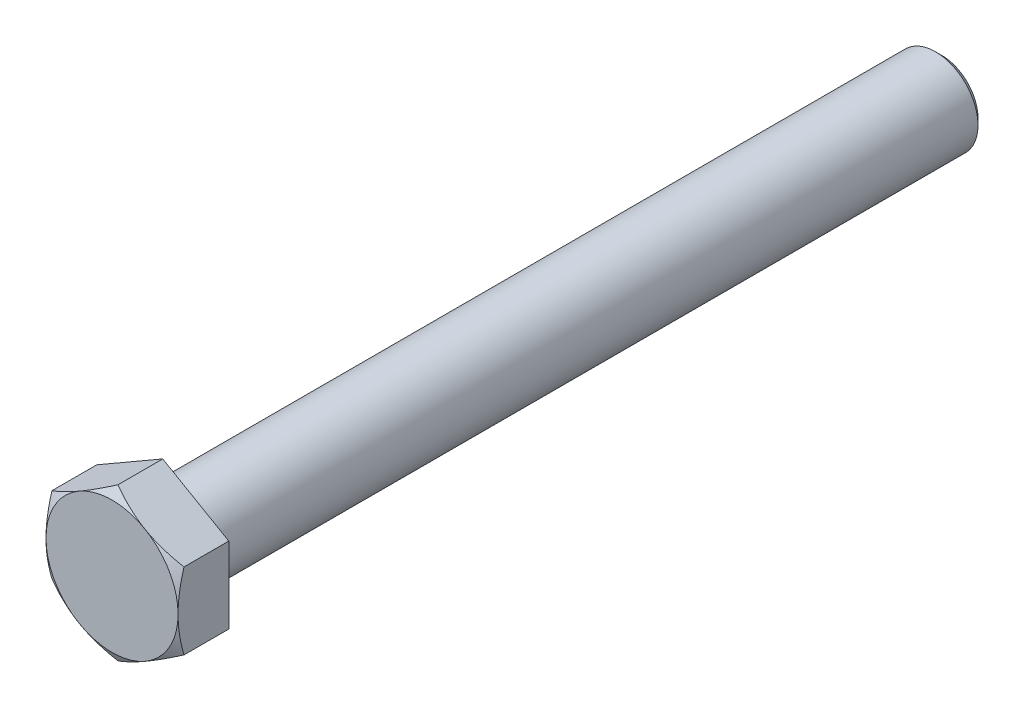
ISO-10303-21;
HEADER;
FILE_DESCRIPTION(('STEP AP214'),'2;1');
FILE_NAME('part.step','',(''),(''),'','','');
FILE_SCHEMA(('AUTOMOTIVE_DESIGN { 1 0 10303 214 1 1 1 1 }'));
ENDSEC;
DATA;
#1=APPLICATION_CONTEXT('core data for automotive mechanical design processes');
#2=APPLICATION_PROTOCOL_DEFINITION('international standard','automotive_design',2000,#1);
#3=PRODUCT_CONTEXT('',#1,'mechanical');
#4=PRODUCT('Part','Part','',(#3));
#5=PRODUCT_RELATED_PRODUCT_CATEGORY('part','',(#4));
#6=PRODUCT_DEFINITION_FORMATION('','',#4);
#7=PRODUCT_DEFINITION_CONTEXT('part definition',#1,'design');
#8=PRODUCT_DEFINITION('design','',#6,#7);
#9=PRODUCT_DEFINITION_SHAPE('','',#8);
#10=(LENGTH_UNIT() NAMED_UNIT(*) SI_UNIT(.MILLI.,.METRE.));
#11=(NAMED_UNIT(*) PLANE_ANGLE_UNIT() SI_UNIT($,.RADIAN.));
#12=(NAMED_UNIT(*) SI_UNIT($,.STERADIAN.) SOLID_ANGLE_UNIT());
#13=UNCERTAINTY_MEASURE_WITH_UNIT(LENGTH_MEASURE(1.E-05),#10,'distance_accuracy_value','');
#14=(GEOMETRIC_REPRESENTATION_CONTEXT(3) GLOBAL_UNCERTAINTY_ASSIGNED_CONTEXT((#13)) GLOBAL_UNIT_ASSIGNED_CONTEXT((#10,
#11,#12)) REPRESENTATION_CONTEXT('',''));
#15=CARTESIAN_POINT('',(0.,0.,0.));
#16=DIRECTION('',(0.,0.,1.));
#17=DIRECTION('',(1.,0.,0.));
#18=AXIS2_PLACEMENT_3D('',#15,#16,#17);
#19=CARTESIAN_POINT('',(0.,0.,0.));
#20=DIRECTION('',(0.,0.,1.));
#21=DIRECTION('',(1.,0.,0.));
#22=AXIS2_PLACEMENT_3D('',#19,#20,#21);
#23=PLANE('',#22);
#24=CARTESIAN_POINT('',(0.,0.,0.));
#25=DIRECTION('',(0.,0.,1.));
#26=DIRECTION('',(1.,0.,0.));
#27=AXIS2_PLACEMENT_3D('',#24,#25,#26);
#28=CIRCLE('',#27,6.6);
#29=CARTESIAN_POINT('',(6.6,0.,0.));
#30=VERTEX_POINT('',#29);
#31=EDGE_CURVE('E183',#30,#30,#28,.T.);
#32=ORIENTED_EDGE('',*,*,#31,.T.);
#33=EDGE_LOOP('',(#32));
#34=FACE_BOUND('',#33,.T.);
#35=CARTESIAN_POINT('',(0.,0.,0.));
#36=DIRECTION('',(0.,0.,1.));
#37=DIRECTION('',(1.,0.,0.));
#38=AXIS2_PLACEMENT_3D('',#35,#36,#37);
#39=CIRCLE('',#38,8.7);
#40=CARTESIAN_POINT('',(8.7,0.,0.));
#41=VERTEX_POINT('',#40);
#42=EDGE_CURVE('E367',#41,#41,#39,.T.);
#43=ORIENTED_EDGE('',*,*,#42,.F.);
#44=EDGE_LOOP('',(#43));
#45=FACE_BOUND('',#44,.T.);
#46=ADVANCED_FACE('F63',(#34,#45),#23,.F.);
#47=CARTESIAN_POINT('',(0.,0.,-0.599999999999934));
#48=DIRECTION('',(0.,0.,1.));
#49=DIRECTION('',(1.,0.,0.));
#50=AXIS2_PLACEMENT_3D('',#47,#48,#49);
#51=TOROIDAL_SURFACE('',#50,6.6,0.6);
#52=ORIENTED_EDGE('',*,*,#31,.F.);
#53=EDGE_LOOP('',(#52));
#54=FACE_BOUND('',#53,.T.);
#55=CARTESIAN_POINT('',(0.,0.,-0.599999999999934));
#56=DIRECTION('',(0.,0.,1.));
#57=DIRECTION('',(1.,0.,0.));
#58=AXIS2_PLACEMENT_3D('',#55,#56,#57);
#59=CIRCLE('',#58,6.00000000000001);
#60=CARTESIAN_POINT('',(6.00000000000001,0.,-0.599999999999902));
#61=VERTEX_POINT('',#60);
#62=EDGE_CURVE('E187',#61,#61,#59,.T.);
#63=ORIENTED_EDGE('',*,*,#62,.T.);
#64=EDGE_LOOP('',(#63));
#65=FACE_BOUND('',#64,.T.);
#66=ADVANCED_FACE('F279',(#54,#65),#51,.F.);
#67=CARTESIAN_POINT('',(0.,0.,0.));
#68=DIRECTION('',(0.,0.,1.));
#69=DIRECTION('',(1.,0.,0.));
#70=AXIS2_PLACEMENT_3D('',#67,#68,#69);
#71=CYLINDRICAL_SURFACE('',#70,6.00000000000001);
#72=ORIENTED_EDGE('',*,*,#62,.F.);
#73=EDGE_LOOP('',(#72));
#74=FACE_BOUND('',#73,.T.);
#75=CARTESIAN_POINT('',(-2.66453525910038E-12,1.55431223447522E-12,-109.1));
#76=DIRECTION('',(0.,0.,1.));
#77=DIRECTION('',(1.,0.,0.));
#78=AXIS2_PLACEMENT_3D('',#75,#76,#77);
#79=CIRCLE('',#78,6.00000000000002);
#80=CARTESIAN_POINT('',(5.99999999999735,1.55431223447285E-12,-109.1));
#81=VERTEX_POINT('',#80);
#82=EDGE_CURVE('E191',#81,#81,#79,.T.);
#83=ORIENTED_EDGE('',*,*,#82,.T.);
#84=EDGE_LOOP('',(#83));
#85=FACE_BOUND('',#84,.T.);
#86=ADVANCED_FACE('F285',(#74,#85),#71,.T.);
#87=CARTESIAN_POINT('',(-2.66453525910038E-12,0.,-110.));
#88=DIRECTION('',(0.,0.,1.));
#89=DIRECTION('',(1.,0.,0.));
#90=AXIS2_PLACEMENT_3D('',#87,#88,#89);
#91=CONICAL_SURFACE('',#90,5.1,0.78539816339745);
#92=ORIENTED_EDGE('',*,*,#82,.F.);
#93=EDGE_LOOP('',(#92));
#94=FACE_BOUND('',#93,.T.);
#95=CARTESIAN_POINT('',(-2.66453525910038E-12,0.,-110.));
#96=DIRECTION('',(0.,0.,1.));
#97=DIRECTION('',(1.,0.,0.));
#98=AXIS2_PLACEMENT_3D('',#95,#96,#97);
#99=CIRCLE('',#98,5.1);
#100=CARTESIAN_POINT('',(5.09999999999734,0.,-110.));
#101=VERTEX_POINT('',#100);
#102=EDGE_CURVE('E154',#101,#101,#99,.T.);
#103=ORIENTED_EDGE('',*,*,#102,.T.);
#104=EDGE_LOOP('',(#103));
#105=FACE_BOUND('',#104,.T.);
#106=ADVANCED_FACE('F382',(#94,#105),#91,.T.);
#107=CARTESIAN_POINT('',(-2.66453525910038E-12,5.1000000000001,-109.999999999989));
#108=DIRECTION('',(0.,0.,1.));
#109=DIRECTION('',(1.,0.,0.));
#110=AXIS2_PLACEMENT_3D('',#107,#108,#109);
#111=PLANE('',#110);
#112=ORIENTED_EDGE('',*,*,#102,.F.);
#113=EDGE_LOOP('',(#112));
#114=FACE_BOUND('',#113,.T.);
#115=ADVANCED_FACE('F378',(#114),#111,.F.);
#116=CARTESIAN_POINT('',(-2.66453525910038E-12,10.7791295257702,0.150000000010753));
#117=DIRECTION('',(0.,0.,-1.));
#118=DIRECTION('',(-1.,0.,0.));
#119=AXIS2_PLACEMENT_3D('',#116,#117,#118);
#120=PLANE('',#119);
#121=CARTESIAN_POINT('',(0.,0.,0.150000000000095));
#122=DIRECTION('',(0.,0.,1.));
#123=DIRECTION('',(1.,0.,0.));
#124=AXIS2_PLACEMENT_3D('',#121,#122,#123);
#125=CIRCLE('',#124,8.78660254037844);
#126=CARTESIAN_POINT('',(8.78660254037844,0.,0.150000000000141));
#127=VERTEX_POINT('',#126);
#128=EDGE_CURVE('E362',#127,#127,#125,.T.);
#129=ORIENTED_EDGE('',*,*,#128,.T.);
#130=EDGE_LOOP('',(#129));
#131=FACE_BOUND('',#130,.T.);
#132=DIRECTION('',(0.866025403784439,-0.5,0.));
#133=VECTOR('',#132,1.);
#134=CARTESIAN_POINT('',(9.33500000000032,5.38956476288466,0.150000000001205));
#135=LINE('',#134,#133);
#136=CARTESIAN_POINT('',(-2.66453525910038E-12,10.7791295257702,0.150000000010753));
#137=VERTEX_POINT('',#136);
#138=CARTESIAN_POINT('',(9.33500000000032,5.38956476288466,0.150000000001205));
#139=VERTEX_POINT('',#138);
#140=EDGE_CURVE('E87',#137,#139,#135,.T.);
#141=ORIENTED_EDGE('',*,*,#140,.T.);
#142=DIRECTION('',(0.,-1.,0.));
#143=VECTOR('',#142,1.);
#144=CARTESIAN_POINT('',(9.33499999999521,-5.38956476288555,0.150000000009198));
#145=LINE('',#144,#143);
#146=CARTESIAN_POINT('',(9.33499999999521,-5.38956476288577,0.150000000009198));
#147=VERTEX_POINT('',#146);
#148=EDGE_CURVE('E13',#139,#147,#145,.T.);
#149=ORIENTED_EDGE('',*,*,#148,.T.);
#150=DIRECTION('',(-0.866025403784439,-0.5,0.));
#151=VECTOR('',#150,1.);
#152=CARTESIAN_POINT('',(0.,-10.7791295257704,0.150000000000095));
#153=LINE('',#152,#151);
#154=CARTESIAN_POINT('',(0.,-10.7791295257704,0.150000000000095));
#155=VERTEX_POINT('',#154);
#156=EDGE_CURVE('E203',#147,#155,#153,.T.);
#157=ORIENTED_EDGE('',*,*,#156,.T.);
#158=DIRECTION('',(-0.866025403784439,0.5,0.));
#159=VECTOR('',#158,1.);
#160=CARTESIAN_POINT('',(-9.33499999999543,-5.38956476288577,0.150000000009198));
#161=LINE('',#160,#159);
#162=CARTESIAN_POINT('',(-9.33499999999543,-5.38956476288577,0.150000000009198));
#163=VERTEX_POINT('',#162);
#164=EDGE_CURVE('E200',#155,#163,#161,.T.);
#165=ORIENTED_EDGE('',*,*,#164,.T.);
#166=DIRECTION('',(0.,1.,0.));
#167=VECTOR('',#166,1.);
#168=CARTESIAN_POINT('',(-9.33500000000076,5.38956476288444,0.150000000001205));
#169=LINE('',#168,#167);
#170=CARTESIAN_POINT('',(-9.33500000000076,5.38956476288444,0.150000000001205));
#171=VERTEX_POINT('',#170);
#172=EDGE_CURVE('E138',#163,#171,#169,.T.);
#173=ORIENTED_EDGE('',*,*,#172,.T.);
#174=DIRECTION('',(0.866025403784439,0.499999999999999,0.));
#175=VECTOR('',#174,1.);
#176=CARTESIAN_POINT('',(-2.66453525910038E-12,10.7791295257702,0.150000000010753));
#177=LINE('',#176,#175);
#178=EDGE_CURVE('E135',#171,#137,#177,.T.);
#179=ORIENTED_EDGE('',*,*,#178,.T.);
#180=EDGE_LOOP('',(#141,#149,#157,#165,#173,#179));
#181=FACE_BOUND('',#180,.T.);
#182=ADVANCED_FACE('F136',(#131,#181),#120,.T.);
#183=CARTESIAN_POINT('',(0.,0.,0.150000000000095));
#184=DIRECTION('',(0.,0.,1.));
#185=DIRECTION('',(1.,0.,0.));
#186=AXIS2_PLACEMENT_3D('',#183,#184,#185);
#187=CONICAL_SURFACE('',#186,8.78660254037844,0.5235987755983);
#188=ORIENTED_EDGE('',*,*,#42,.T.);
#189=EDGE_LOOP('',(#188));
#190=FACE_BOUND('',#189,.T.);
#191=ORIENTED_EDGE('',*,*,#128,.F.);
#192=EDGE_LOOP('',(#191));
#193=FACE_BOUND('',#192,.T.);
#194=ADVANCED_FACE('F229',(#190,#193),#187,.T.);
#195=CARTESIAN_POINT('',(9.33499999999521,-5.38956476288632,7.32000000000954));
#196=DIRECTION('',(-1.,0.,0.));
#197=DIRECTION('',(0.,-1.,0.));
#198=AXIS2_PLACEMENT_3D('',#195,#196,#197);
#199=PLANE('',#198);
#200=CARTESIAN_POINT('',(9.3350000000052,-14.293920006569,2.85295320593915));
#201=CARTESIAN_POINT('',(9.33499999999891,-14.0889979748924,2.95200947811314));
#202=CARTESIAN_POINT('',(9.33499999999624,-13.8838282501428,3.0505530905864));
#203=CARTESIAN_POINT('',(9.33499999999423,-13.4729410981221,3.24649731903918));
#204=CARTESIAN_POINT('',(9.33499999999488,-13.2672236648771,3.34389792248868));
#205=CARTESIAN_POINT('',(9.33499999999593,-12.6491110540922,3.63423693700223));
#206=CARTESIAN_POINT('',(9.33499999999542,-12.2358221904249,3.82528025364381));
#207=CARTESIAN_POINT('',(9.33499999999504,-11.4040234451105,4.20217310927833));
#208=CARTESIAN_POINT('',(9.33499999999518,-10.9854972201138,4.38798667007247));
#209=CARTESIAN_POINT('',(9.33499999999527,-10.1450055951429,4.75163580728445));
#210=CARTESIAN_POINT('',(9.33499999999524,-9.72304037579501,4.92947179955779));
#211=CARTESIAN_POINT('',(9.33499999999521,-8.86976005800029,5.27715066645903));
#212=CARTESIAN_POINT('',(9.33499999999522,-8.43839377157641,5.44686860657921));
#213=CARTESIAN_POINT('',(9.33499999999522,-7.57057438679324,5.77301256488771));
#214=CARTESIAN_POINT('',(9.33499999999522,-7.13412072861586,5.9294371042547));
#215=CARTESIAN_POINT('',(9.33499999999521,-6.25632320665389,6.22479025997486));
#216=CARTESIAN_POINT('',(9.33499999999522,-5.81499199640561,6.36375607260732));
#217=CARTESIAN_POINT('',(9.33499999999521,-4.926071334869,6.61968098547653));
#218=CARTESIAN_POINT('',(9.33499999999521,-4.47848391093945,6.73664704501836));
#219=CARTESIAN_POINT('',(9.33499999999521,-3.57667031207917,6.94288552890779));
#220=CARTESIAN_POINT('',(9.33499999999521,-3.12244240314022,7.03215057946999));
#221=CARTESIAN_POINT('',(9.33499999999521,-2.43710350689389,7.1408028211713));
#222=CARTESIAN_POINT('',(9.3349999999952,-2.20796291906161,7.17281503726789));
#223=CARTESIAN_POINT('',(9.33499999999521,-1.74860743174466,7.22779448911046));
#224=CARTESIAN_POINT('',(9.33499999999523,-1.51839264090194,7.25076262031284));
#225=CARTESIAN_POINT('',(9.33499999999519,-1.05866032543573,7.28703579917145));
#226=CARTESIAN_POINT('',(9.33499999999513,-0.829147554397095,7.30040085150142));
#227=CARTESIAN_POINT('',(9.33499999999528,-0.36976199715621,7.31739721140636));
#228=CARTESIAN_POINT('',(9.33499999999548,-0.139889215668003,7.32102864538625));
#229=CARTESIAN_POINT('',(9.33499999999493,0.319737952099457,7.31847123986833));
#230=CARTESIAN_POINT('',(9.33499999999417,0.549492353500248,7.31228515640284));
#231=CARTESIAN_POINT('',(9.33499999999624,1.00854016574407,7.29024654738927));
#232=CARTESIAN_POINT('',(9.33499999999909,1.23783355299208,7.2743935391115));
#233=CARTESIAN_POINT('',(9.33500000000045,1.79357012506222,7.2245863545867));
#234=CARTESIAN_POINT('',(9.33499999999661,2.11958632864142,7.18578870330947));
#235=CARTESIAN_POINT('',(9.3349999999938,2.76912050377091,7.09080439036909));
#236=CARTESIAN_POINT('',(9.33499999999483,3.09263776869831,7.03461298239965));
#237=CARTESIAN_POINT('',(9.33499999999558,3.73690716837019,6.90683408562929));
#238=CARTESIAN_POINT('',(9.3349999999953,4.05765638834971,6.83523203973706));
#239=CARTESIAN_POINT('',(9.33499999999511,4.69585477456245,6.67881653034498));
#240=CARTESIAN_POINT('',(9.33499999999519,5.01330424867442,6.59400431142417));
#241=CARTESIAN_POINT('',(9.33499999999523,5.652721853529,6.41098051072758));
#242=CARTESIAN_POINT('',(9.33499999999518,5.97461000804994,6.31249144069609));
#243=CARTESIAN_POINT('',(9.33499999999523,6.6149839511621,6.10578201115883));
#244=CARTESIAN_POINT('',(9.33499999999534,6.93347191931008,5.99756836371344));
#245=CARTESIAN_POINT('',(9.33499999999508,7.56576751363311,5.77364503844998));
#246=CARTESIAN_POINT('',(9.33499999999472,7.87959139359839,5.65798098174576));
#247=CARTESIAN_POINT('',(9.3349999999957,8.50480431543438,5.41986404687469));
#248=CARTESIAN_POINT('',(9.33499999999704,8.81619231437381,5.29740842489781));
#249=CARTESIAN_POINT('',(9.33500000000032,9.12644907509852,5.17222885598723));
#250=B_SPLINE_CURVE_WITH_KNOTS('',3,(#200,#201,#202,#203,#204,#205,#206,#207,#208,#209,#210,
#211,#212,#213,#214,#215,#216,#217,#218,#219,#220,#221,#222,#223,#224,#225,#226,#227,#228,#229,
#230,#231,#232,#233,#234,#235,#236,#237,#238,#239,#240,#241,#242,#243,#244,#245,#246,#247,#248,
#249),.UNSPECIFIED.,.F.,.F.,(4,2,2,2,2,2,2,2,2,2,2,2,2,2,2,2,2,2,2,2,2,2,2,2,4),(0.,
0.682821242993022,1.36564996430018,2.73152951663887,4.10522544602778,5.47884968384844,
6.86933776425463,8.25998032725456,9.64760794835491,11.0347958724484,12.4223527386713,
13.1163000222216,13.8101785806449,14.4996828280969,15.1891781213088,15.8784798895048,
16.5678160816453,17.5522174713355,18.5368877158509,19.5224922074135,20.5080038976525,
21.5176726092943,22.5266497067146,23.5299476031846,24.5336538298063),.UNSPECIFIED.);
#251=CARTESIAN_POINT('',(9.33499999999521,-5.38956476288788,6.48623142956128));
#252=VERTEX_POINT('',#251);
#253=CARTESIAN_POINT('',(9.33499999999965,-1.11022302462516E-12,7.32000000000421));
#254=VERTEX_POINT('',#253);
#255=EDGE_CURVE('E354',#252,#254,#250,.T.);
#256=ORIENTED_EDGE('',*,*,#255,.F.);
#257=DIRECTION('',(0.,0.,-1.));
#258=VECTOR('',#257,1.);
#259=CARTESIAN_POINT('',(9.33499999999521,-5.38956476288632,7.32000000000954));
#260=LINE('',#259,#258);
#261=EDGE_CURVE('E177',#252,#147,#260,.T.);
#262=ORIENTED_EDGE('',*,*,#261,.T.);
#263=ORIENTED_EDGE('',*,*,#148,.F.);
#264=DIRECTION('',(0.,0.,-1.));
#265=VECTOR('',#264,1.);
#266=CARTESIAN_POINT('',(9.33500000000032,5.38956476288388,7.3200000000011));
#267=LINE('',#266,#265);
#268=CARTESIAN_POINT('',(9.33499999999943,5.38956476288255,6.48623142955329));
#269=VERTEX_POINT('',#268);
#270=EDGE_CURVE('E152',#269,#139,#267,.T.);
#271=ORIENTED_EDGE('',*,*,#270,.F.);
#272=EDGE_CURVE('E234',#254,#269,#250,.T.);
#273=ORIENTED_EDGE('',*,*,#272,.F.);
#274=EDGE_LOOP('',(#256,#262,#263,#271,#273));
#275=FACE_BOUND('',#274,.T.);
#276=ADVANCED_FACE('F290',(#275),#199,.F.);
#277=CARTESIAN_POINT('',(0.,-10.7791295257755,7.31999999999999));
#278=DIRECTION('',(-0.499999999999999,0.866025403784439,0.));
#279=DIRECTION('',(-0.866025403784439,-0.5,0.));
#280=AXIS2_PLACEMENT_3D('',#277,#278,#279);
#281=PLANE('',#280);
#282=CARTESIAN_POINT('',(-0.000199999999894729,-10.7792449958242,6.48616476181374));
#283=CARTESIAN_POINT('',(0.205003739618677,-10.6607705615199,6.55455498933212));
#284=CARTESIAN_POINT('',(0.410972586004931,-10.5418543926155,6.61984121047945));
#285=CARTESIAN_POINT('',(0.824561997186706,-10.3030684347368,6.74334436956653));
#286=CARTESIAN_POINT('',(1.03218308144301,-10.1831983458516,6.80155898243248));
#287=CARTESIAN_POINT('',(1.65839174727736,-9.82165660406272,6.96446882046476));
#288=CARTESIAN_POINT('',(2.0794513746149,-9.57855771487475,7.05713121773747));
#289=CARTESIAN_POINT('',(2.70954783258533,-9.21477135525029,7.16578659054639));
#290=CARTESIAN_POINT('',(2.91670220163508,-9.09517072451565,7.19673843665258));
#291=CARTESIAN_POINT('',(3.33197005561744,-8.85541571723294,7.24864273857737));
#292=CARTESIAN_POINT('',(3.54008355893221,-8.73526133007191,7.26959500193874));
#293=CARTESIAN_POINT('',(3.95665771618454,-8.49475212824553,7.30096329051052));
#294=CARTESIAN_POINT('',(4.16511766131825,-8.37439772280828,7.31139183643182));
#295=CARTESIAN_POINT('',(4.58223010787757,-8.13357773950232,7.32149109381549));
#296=CARTESIAN_POINT('',(4.79088260315483,-8.01311216518336,7.32116213764982));
#297=CARTESIAN_POINT('',(5.18096381451784,-7.78789867279763,7.31049475071877));
#298=CARTESIAN_POINT('',(5.36242006195994,-7.68313485949393,7.30145760929093));
#299=CARTESIAN_POINT('',(5.72490816972366,-7.47385225290089,7.27542267819828));
#300=CARTESIAN_POINT('',(5.90593999911398,-7.36933347746973,7.25842432540492));
#301=CARTESIAN_POINT('',(6.44833403144247,-7.05618213689675,7.1958893355017));
#302=CARTESIAN_POINT('',(6.80873615765812,-6.84810387231012,7.13882055798183));
#303=CARTESIAN_POINT('',(7.53336341948346,-6.42974012763387,6.9961480122022));
#304=CARTESIAN_POINT('',(7.89749607658087,-6.21950804003821,6.909939472466));
#305=CARTESIAN_POINT('',(8.62033129112425,-5.80217893434057,6.71428185816434));
#306=CARTESIAN_POINT('',(8.9790431047511,-5.59507657218008,6.60487873715515));
#307=CARTESIAN_POINT('',(9.33519999999488,-5.38944929283414,6.48616476182329));
#308=B_SPLINE_CURVE_WITH_KNOTS('',3,(#282,#283,#284,#285,#286,#287,#288,#289,#290,#291,#292,
#293,#294,#295,#296,#297,#298,#299,#300,#301,#302,#303,#304,#305,#306,#307),.UNSPECIFIED.,.F.,
.F.,(4,2,2,2,2,2,2,2,2,2,2,2,4),(0.,0.739804294915854,1.47985117544356,2.96309532775769,
3.68651340422434,4.40994540341464,5.13251567287136,5.85506361726955,6.48407412042993,
7.1131291227587,8.37213305715012,9.65905881820603,10.9434583334545),.UNSPECIFIED.);
#309=CARTESIAN_POINT('',(0.,-10.7791295257702,6.48623142955174));
#310=VERTEX_POINT('',#309);
#311=CARTESIAN_POINT('',(4.66750000000005,-8.08434714433037,7.31999999999888));
#312=VERTEX_POINT('',#311);
#313=EDGE_CURVE('E304',#310,#312,#308,.T.);
#314=ORIENTED_EDGE('',*,*,#313,.F.);
#315=DIRECTION('',(0.,0.,-1.));
#316=VECTOR('',#315,1.);
#317=CARTESIAN_POINT('',(0.,-10.7791295257755,7.31999999999999));
#318=LINE('',#317,#316);
#319=EDGE_CURVE('E173',#310,#155,#318,.T.);
#320=ORIENTED_EDGE('',*,*,#319,.T.);
#321=ORIENTED_EDGE('',*,*,#156,.F.);
#322=ORIENTED_EDGE('',*,*,#261,.F.);
#323=EDGE_CURVE('E244',#312,#252,#308,.T.);
#324=ORIENTED_EDGE('',*,*,#323,.F.);
#325=EDGE_LOOP('',(#314,#320,#321,#322,#324));
#326=FACE_BOUND('',#325,.T.);
#327=ADVANCED_FACE('F293',(#326),#281,.F.);
#328=CARTESIAN_POINT('',(-9.33499999999543,-5.38956476288766,7.32000000000954));
#329=DIRECTION('',(0.5,0.866025403784439,0.));
#330=DIRECTION('',(-0.866025403784439,0.5,0.));
#331=AXIS2_PLACEMENT_3D('',#328,#329,#330);
#332=PLANE('',#331);
#333=CARTESIAN_POINT('',(-9.3351999999951,-5.38944929283236,6.48616476182329));
#334=CARTESIAN_POINT('',(-9.12999626037727,-5.50792372714048,6.55455498933569));
#335=CARTESIAN_POINT('',(-8.92402741399148,-5.62683989604643,6.61984121048043));
#336=CARTESIAN_POINT('',(-8.51043800281035,-5.86562585392616,6.74334436956546));
#337=CARTESIAN_POINT('',(-8.30281691855423,-5.98549594281076,6.80155898243195));
#338=CARTESIAN_POINT('',(-7.6766082527203,-6.3470376845987,6.96446882046505));
#339=CARTESIAN_POINT('',(-7.2555486253831,-6.59013657378684,7.0571312177372));
#340=CARTESIAN_POINT('',(-6.6254521674132,-6.95392293341116,7.16578659054583));
#341=CARTESIAN_POINT('',(-6.41829779836366,-7.07352356414568,7.19673843665201));
#342=CARTESIAN_POINT('',(-6.00302994438167,-7.31327857142809,7.24864273857693));
#343=CARTESIAN_POINT('',(-5.79491644106702,-7.43343295858895,7.26959500193843));
#344=CARTESIAN_POINT('',(-5.37834228381522,-7.6739421604153,7.30096329050985));
#345=CARTESIAN_POINT('',(-5.16988233868191,-7.79429656585271,7.31139183643067));
#346=CARTESIAN_POINT('',(-4.75276989212259,-8.03511654915761,7.32149109381583));
#347=CARTESIAN_POINT('',(-4.54411739684494,-8.15558212347535,7.32116213765213));
#348=CARTESIAN_POINT('',(-4.15403618548212,-8.38079561586119,7.3104947507209));
#349=CARTESIAN_POINT('',(-3.97257993804043,-8.48555942916592,7.3014576092914));
#350=CARTESIAN_POINT('',(-3.61009183027676,-8.69484203575992,7.27542267819754));
#351=CARTESIAN_POINT('',(-3.42906000088607,-8.79936081119098,7.25842432540462));
#352=CARTESIAN_POINT('',(-2.88666596855663,-9.11251215176396,7.19588933550203));
#353=CARTESIAN_POINT('',(-2.52626384234063,-9.32059041635094,7.13882055798164));
#354=CARTESIAN_POINT('',(-1.80163658051436,-9.73895416102818,6.99614801220201));
#355=CARTESIAN_POINT('',(-1.43750392341638,-9.94918624862451,6.90993947246635));
#356=CARTESIAN_POINT('',(-0.714668708871814,-10.3665153543217,6.71428185816288));
#357=CARTESIAN_POINT('',(-0.355956895244346,-10.5736177164811,6.60487873715135));
#358=CARTESIAN_POINT('',(0.000200000000116773,-10.7792449958242,6.48616476181374));
#359=B_SPLINE_CURVE_WITH_KNOTS('',3,(#333,#334,#335,#336,#337,#338,#339,#340,#341,#342,#343,
#344,#345,#346,#347,#348,#349,#350,#351,#352,#353,#354,#355,#356,#357,#358),.UNSPECIFIED.,.F.,
.F.,(4,2,2,2,2,2,2,2,2,2,2,2,4),(0.,0.739804294914861,1.47985117544177,2.96309532775486,
3.68651340422079,4.40994540341047,5.13251567286642,5.85506361726374,6.48407412042478,
7.11312912275432,8.37213305714737,9.65905881820528,10.9434583334556),.UNSPECIFIED.);
#360=CARTESIAN_POINT('',(-9.33499999999543,-5.38956476288632,6.48623142956128));
#361=VERTEX_POINT('',#360);
#362=CARTESIAN_POINT('',(-4.66750000000005,-8.08434714433037,7.32000000000421));
#363=VERTEX_POINT('',#362);
#364=EDGE_CURVE('E266',#361,#363,#359,.T.);
#365=ORIENTED_EDGE('',*,*,#364,.F.);
#366=DIRECTION('',(0.,0.,-1.));
#367=VECTOR('',#366,1.);
#368=CARTESIAN_POINT('',(-9.33499999999543,-5.38956476288766,7.32000000000954));
#369=LINE('',#368,#367);
#370=EDGE_CURVE('E167',#361,#163,#369,.T.);
#371=ORIENTED_EDGE('',*,*,#370,.T.);
#372=ORIENTED_EDGE('',*,*,#164,.F.);
#373=ORIENTED_EDGE('',*,*,#319,.F.);
#374=EDGE_CURVE('E252',#363,#310,#359,.T.);
#375=ORIENTED_EDGE('',*,*,#374,.F.);
#376=EDGE_LOOP('',(#365,#371,#372,#373,#375));
#377=FACE_BOUND('',#376,.T.);
#378=ADVANCED_FACE('F270',(#377),#332,.F.);
#379=CARTESIAN_POINT('',(-9.33499999999543,5.38956476288255,7.3200000000011));
#380=DIRECTION('',(1.,0.,0.));
#381=DIRECTION('',(0.,0.,-1.));
#382=AXIS2_PLACEMENT_3D('',#379,#380,#381);
#383=PLANE('',#382);
#384=CARTESIAN_POINT('',(-9.33500000000476,-14.293920006569,2.85295320593382));
#385=CARTESIAN_POINT('',(-9.33499999999885,-14.0889979748929,2.95200947810881));
#386=CARTESIAN_POINT('',(-9.33499999999635,-13.8838282501436,3.05055309058247));
#387=CARTESIAN_POINT('',(-9.33499999999446,-13.472941098123,3.24649731903549));
#388=CARTESIAN_POINT('',(-9.33499999999508,-13.267223664878,3.34389792248485));
#389=CARTESIAN_POINT('',(-9.33499999999607,-12.649111054093,3.63423693699811));
#390=CARTESIAN_POINT('',(-9.33499999999559,-12.2358221904258,3.8252802536397));
#391=CARTESIAN_POINT('',(-9.33499999999524,-11.4040234451112,4.20217310927423));
#392=CARTESIAN_POINT('',(-9.33499999999537,-10.9854972201142,4.38798667006837));
#393=CARTESIAN_POINT('',(-9.33499999999547,-10.1450055951428,4.75163580728036));
#394=CARTESIAN_POINT('',(-9.33499999999543,-9.72304037579469,4.92947179955372));
#395=CARTESIAN_POINT('',(-9.33499999999541,-8.86976005799949,5.2771506664549));
#396=CARTESIAN_POINT('',(-9.33499999999542,-8.43839377157536,5.44686860657498));
#397=CARTESIAN_POINT('',(-9.33499999999543,-7.57057438679167,5.77301256488362));
#398=CARTESIAN_POINT('',(-9.33499999999542,-7.13412072861404,5.92943710425084));
#399=CARTESIAN_POINT('',(-9.33499999999542,-6.25632320665144,6.22479025997018));
#400=CARTESIAN_POINT('',(-9.33499999999542,-5.81499199640278,6.3637560726016));
#401=CARTESIAN_POINT('',(-9.33499999999543,-4.92607133486661,6.61968098547307));
#402=CARTESIAN_POINT('',(-9.33499999999543,-4.47848391093788,6.73664704501819));
#403=CARTESIAN_POINT('',(-9.33499999999543,-3.57667031207779,6.94288552890703));
#404=CARTESIAN_POINT('',(-9.33499999999543,-3.12244240313822,7.03215057946536));
#405=CARTESIAN_POINT('',(-9.33499999999543,-2.43710350689178,7.1408028211652));
#406=CARTESIAN_POINT('',(-9.33499999999543,-2.20796291905955,7.17281503726203));
#407=CARTESIAN_POINT('',(-9.33499999999543,-1.74860743174266,7.22779448910471));
#408=CARTESIAN_POINT('',(-9.33499999999542,-1.51839264089995,7.25076262030698));
#409=CARTESIAN_POINT('',(-9.33499999999544,-1.05866032543381,7.28703579916537));
#410=CARTESIAN_POINT('',(-9.33499999999545,-0.82914755439524,7.30040085149525));
#411=CARTESIAN_POINT('',(-9.33499999999541,-0.369761997154412,7.31739721140032));
#412=CARTESIAN_POINT('',(-9.33499999999535,-0.139889215666196,7.32102864538045));
#413=CARTESIAN_POINT('',(-9.33499999999551,0.319737952101088,7.31847123986175));
#414=CARTESIAN_POINT('',(-9.33499999999574,0.549492353501694,7.31228515639527));
#415=CARTESIAN_POINT('',(-9.33499999999512,1.00854016574544,7.29024654738439));
#416=CARTESIAN_POINT('',(-9.33499999999427,1.23783355299356,7.27439353911029));
#417=CARTESIAN_POINT('',(-9.33499999999386,1.79357012506335,7.22458635458734));
#418=CARTESIAN_POINT('',(-9.33499999999501,2.11958632864182,7.18578870330523));
#419=CARTESIAN_POINT('',(-9.33499999999585,2.76912050377068,7.09080439036136));
#420=CARTESIAN_POINT('',(-9.33499999999554,3.09263776869818,7.03461298239331));
#421=CARTESIAN_POINT('',(-9.33499999999531,3.73690716837026,6.90683408562404));
#422=CARTESIAN_POINT('',(-9.33499999999539,4.05765638834987,6.8352320397315));
#423=CARTESIAN_POINT('',(-9.33499999999546,4.69585477456273,6.67881653033926));
#424=CARTESIAN_POINT('',(-9.33499999999544,5.01330424867474,6.59400431141861));
#425=CARTESIAN_POINT('',(-9.33499999999541,5.65272185352959,6.41098051072218));
#426=CARTESIAN_POINT('',(-9.33499999999539,5.97461000805076,6.31249144069068));
#427=CARTESIAN_POINT('',(-9.33499999999546,6.61498395116329,6.10578201115338));
#428=CARTESIAN_POINT('',(-9.33499999999553,6.93347191931139,5.99756836370796));
#429=CARTESIAN_POINT('',(-9.33499999999532,7.56576751363454,5.77364503844478));
#430=CARTESIAN_POINT('',(-9.33499999999504,7.87959139359981,5.65798098174089));
#431=CARTESIAN_POINT('',(-9.33499999999581,8.50480431543548,5.41986404686938));
#432=CARTESIAN_POINT('',(-9.33499999999686,8.81619231437459,5.29740842489175));
#433=CARTESIAN_POINT('',(-9.33499999999943,9.12644907509852,5.17222885597923));
#434=B_SPLINE_CURVE_WITH_KNOTS('',3,(#384,#385,#386,#387,#388,#389,#390,#391,#392,#393,#394,
#395,#396,#397,#398,#399,#400,#401,#402,#403,#404,#405,#406,#407,#408,#409,#410,#411,#412,#413,
#414,#415,#416,#417,#418,#419,#420,#421,#422,#423,#424,#425,#426,#427,#428,#429,#430,#431,#432,
#433),.UNSPECIFIED.,.F.,.F.,(4,2,2,2,2,2,2,2,2,2,2,2,2,2,2,2,2,2,2,2,2,2,2,2,4),(0.,
0.682821242992933,1.3656499643,2.7315295166386,4.10522544602822,5.47884968384949,
6.86933776425634,8.25998032725713,9.64760794835781,11.0347958724513,12.4223527386736,
13.1163000222239,13.8101785806472,14.499682828099,15.1891781213108,15.8784798895065,
16.5678160816465,17.552217471336,18.5368877158512,19.5224922074142,20.5080038976532,
21.5176726092957,22.5266497067164,23.529947603186,24.5336538298076),.UNSPECIFIED.);
#435=CARTESIAN_POINT('',(-9.33499999999943,5.3895647628841,6.48623142955329));
#436=VERTEX_POINT('',#435);
#437=CARTESIAN_POINT('',(-9.33499999999143,-2.66453525910038E-12,7.31999999999577));
#438=VERTEX_POINT('',#437);
#439=EDGE_CURVE('E265',#436,#438,#434,.F.);
#440=ORIENTED_EDGE('',*,*,#439,.F.);
#441=DIRECTION('',(0.,0.,-1.));
#442=VECTOR('',#441,1.);
#443=CARTESIAN_POINT('',(-9.33499999999543,5.38956476288255,7.3200000000011));
#444=LINE('',#443,#442);
#445=EDGE_CURVE('E161',#436,#171,#444,.T.);
#446=ORIENTED_EDGE('',*,*,#445,.T.);
#447=ORIENTED_EDGE('',*,*,#172,.F.);
#448=ORIENTED_EDGE('',*,*,#370,.F.);
#449=EDGE_CURVE('E258',#438,#361,#434,.F.);
#450=ORIENTED_EDGE('',*,*,#449,.F.);
#451=EDGE_LOOP('',(#440,#446,#447,#448,#450));
#452=FACE_BOUND('',#451,.T.);
#453=ADVANCED_FACE('F267',(#452),#383,.F.);
#454=CARTESIAN_POINT('',(2.66453525910038E-12,10.7791295257651,7.32000000001065));
#455=DIRECTION('',(0.499999999999999,-0.866025403784439,0.));
#456=DIRECTION('',(0.866025403784439,0.499999999999999,0.));
#457=AXIS2_PLACEMENT_3D('',#454,#455,#456);
#458=PLANE('',#457);
#459=CARTESIAN_POINT('',(0.000199999999894729,10.7792449958242,6.48616476182484));
#460=CARTESIAN_POINT('',(-0.205003739616705,10.6607705615135,6.55455498933595));
#461=CARTESIAN_POINT('',(-0.410972586001901,10.5418543926065,6.61984121048008));
#462=CARTESIAN_POINT('',(-0.824561997182476,10.303068434726,6.74334436956454));
#463=CARTESIAN_POINT('',(-1.03218308143863,10.1831983458417,6.80155898243106));
#464=CARTESIAN_POINT('',(-1.65839174727263,9.82165660405433,6.96446882046414));
#465=CARTESIAN_POINT('',(-2.07945137460973,9.57855771486603,7.05713121773606));
#466=CARTESIAN_POINT('',(-2.70954783257947,9.21477135524157,7.16578659054439));
#467=CARTESIAN_POINT('',(-2.91670220162895,9.09517072450704,7.19673843665048));
#468=CARTESIAN_POINT('',(-3.33197005561103,8.85541571722484,7.24864273857536));
#469=CARTESIAN_POINT('',(-3.5400835589258,8.73526133006423,7.26959500193691));
#470=CARTESIAN_POINT('',(-3.95665771617714,8.49475212823723,7.30096329050787));
#471=CARTESIAN_POINT('',(-4.16511766130986,8.37439772279894,7.31139183642819));
#472=CARTESIAN_POINT('',(-4.58223010787051,8.13357773949664,7.32149109381442));
#473=CARTESIAN_POINT('',(-4.79088260315008,8.01311216518238,7.3211621376523));
#474=CARTESIAN_POINT('',(-5.18096381451263,7.78789867279604,7.31049475072074));
#475=CARTESIAN_POINT('',(-5.36242006195264,7.6831348594882,7.30145760928975));
#476=CARTESIAN_POINT('',(-5.72490816971525,7.47385225289174,7.27542267819468));
#477=CARTESIAN_POINT('',(-5.90593999910654,7.36933347746133,7.25842432540204));
#478=CARTESIAN_POINT('',(-6.44833403143724,7.05618213688926,7.19588933549986));
#479=CARTESIAN_POINT('',(-6.80873615765334,6.84810387230157,7.13882055797915));
#480=CARTESIAN_POINT('',(-7.53336341947987,6.42974012762328,6.99614801219868));
#481=CARTESIAN_POINT('',(-7.89749607657802,6.21950804002664,6.90993947246249));
#482=CARTESIAN_POINT('',(-8.620331291124,5.80217893432997,6.71428185815983));
#483=CARTESIAN_POINT('',(-8.9790431047527,5.59507657217142,6.60487873714964));
#484=CARTESIAN_POINT('',(-9.33519999999954,5.38944929283014,6.48616476181529));
#485=B_SPLINE_CURVE_WITH_KNOTS('',3,(#459,#460,#461,#462,#463,#464,#465,#466,#467,#468,#469,
#470,#471,#472,#473,#474,#475,#476,#477,#478,#479,#480,#481,#482,#483,#484),.UNSPECIFIED.,.F.,
.F.,(4,2,2,2,2,2,2,2,2,2,2,2,4),(0.,0.73980429491443,1.47985117544098,2.96309532775387,
3.68651340421968,4.4099454034093,5.13251567286506,5.85506361726208,6.4840741204236,
7.11312912275371,8.37213305714806,9.6590588182073,10.9434583334584),.UNSPECIFIED.);
#486=CARTESIAN_POINT('',(0.,10.7791295257704,6.48623142956239));
#487=VERTEX_POINT('',#486);
#488=CARTESIAN_POINT('',(-4.66749999999472,8.08434714432504,7.32000000000421));
#489=VERTEX_POINT('',#488);
#490=EDGE_CURVE('E159',#487,#489,#485,.T.);
#491=ORIENTED_EDGE('',*,*,#490,.F.);
#492=DIRECTION('',(0.,0.,-1.));
#493=VECTOR('',#492,1.);
#494=CARTESIAN_POINT('',(2.66453525910038E-12,10.7791295257651,7.32000000001065));
#495=LINE('',#494,#493);
#496=EDGE_CURVE('E150',#487,#137,#495,.T.);
#497=ORIENTED_EDGE('',*,*,#496,.T.);
#498=ORIENTED_EDGE('',*,*,#178,.F.);
#499=ORIENTED_EDGE('',*,*,#445,.F.);
#500=EDGE_CURVE('E215',#489,#436,#485,.T.);
#501=ORIENTED_EDGE('',*,*,#500,.F.);
#502=EDGE_LOOP('',(#491,#497,#498,#499,#501));
#503=FACE_BOUND('',#502,.T.);
#504=ADVANCED_FACE('F157',(#503),#458,.F.);
#505=CARTESIAN_POINT('',(9.33500000000032,5.38956476288388,7.3200000000011));
#506=DIRECTION('',(-0.5,-0.866025403784439,0.));
#507=DIRECTION('',(0.866025403784439,-0.5,0.));
#508=AXIS2_PLACEMENT_3D('',#505,#506,#507);
#509=PLANE('',#508);
#510=CARTESIAN_POINT('',(9.33519999999954,5.38944929282859,6.48616476181529));
#511=CARTESIAN_POINT('',(9.12999626038297,5.50792372713614,6.55455498933284));
#512=CARTESIAN_POINT('',(8.92402741399769,5.62683989604186,6.61984121047972));
#513=CARTESIAN_POINT('',(8.51043800281692,5.86562585392144,6.74334436956626));
#514=CARTESIAN_POINT('',(8.30281691856065,5.98549594280611,6.80155898243212));
#515=CARTESIAN_POINT('',(7.6766082527265,6.34703768459415,6.9644688204641));
#516=CARTESIAN_POINT('',(7.2555486253894,6.59013657378223,7.05713121773652));
#517=CARTESIAN_POINT('',(6.6254521674195,6.95392293340658,7.16578659054501));
#518=CARTESIAN_POINT('',(6.41829779836991,7.07352356414114,7.19673843665107));
#519=CARTESIAN_POINT('',(6.00302994438777,7.31327857142359,7.24864273857576));
#520=CARTESIAN_POINT('',(5.79491644107306,7.43343295858442,7.26959500193716));
#521=CARTESIAN_POINT('',(5.37834228382125,7.67394216041095,7.30096329050841));
#522=CARTESIAN_POINT('',(5.169882338688,7.79429656584855,7.31139183642917));
#523=CARTESIAN_POINT('',(4.75276989212833,8.03511654915304,7.32149109381398));
#524=CARTESIAN_POINT('',(4.54411739685028,8.15558212347017,7.32116213765));
#525=CARTESIAN_POINT('',(4.15403618548733,8.3807956158562,7.3104947507186));
#526=CARTESIAN_POINT('',(3.97257993804581,8.48555942916159,7.30145760928916));
#527=CARTESIAN_POINT('',(3.6100918302821,8.69484203575616,7.27542267819519));
#528=CARTESIAN_POINT('',(3.42906000089119,8.79936081118716,7.25842432540209));
#529=CARTESIAN_POINT('',(2.88666596856117,9.1125121517602,7.19588933549921));
#530=CARTESIAN_POINT('',(2.52626384234486,9.32059041634751,7.13882055797893));
#531=CARTESIAN_POINT('',(1.8016365805183,9.73895416102499,6.99614801219808));
#532=CARTESIAN_POINT('',(1.43750392342033,9.94918624862121,6.90993947246107));
#533=CARTESIAN_POINT('',(0.714668708874845,10.3665153543191,6.71428185816018));
#534=CARTESIAN_POINT('',(0.355956895246439,10.5736177164792,6.60487873715257));
#535=CARTESIAN_POINT('',(-0.000200000000116773,10.7792449958242,6.48616476182484));
#536=B_SPLINE_CURVE_WITH_KNOTS('',3,(#510,#511,#512,#513,#514,#515,#516,#517,#518,#519,#520,
#521,#522,#523,#524,#525,#526,#527,#528,#529,#530,#531,#532,#533,#534,#535),.UNSPECIFIED.,.F.,
.F.,(4,2,2,2,2,2,2,2,2,2,2,2,4),(0.,0.739804294914961,1.47985117544184,2.96309532775482,
3.68651340422092,4.40994540341072,5.13251567286681,5.85506361726425,6.48407412042581,
7.11312912275586,8.37213305715003,9.65905881820875,10.9434583334595),.UNSPECIFIED.);
#537=CARTESIAN_POINT('',(4.66750000000538,8.08434714432504,7.31999999999888));
#538=VERTEX_POINT('',#537);
#539=EDGE_CURVE('E206',#269,#538,#536,.T.);
#540=ORIENTED_EDGE('',*,*,#539,.F.);
#541=ORIENTED_EDGE('',*,*,#270,.T.);
#542=ORIENTED_EDGE('',*,*,#140,.F.);
#543=ORIENTED_EDGE('',*,*,#496,.F.);
#544=EDGE_CURVE('E207',#538,#487,#536,.T.);
#545=ORIENTED_EDGE('',*,*,#544,.F.);
#546=EDGE_LOOP('',(#540,#541,#542,#543,#545));
#547=FACE_BOUND('',#546,.T.);
#548=ADVANCED_FACE('F65',(#547),#509,.F.);
#549=CARTESIAN_POINT('',(5.32907051820075E-12,-5.32907051820075E-12,7.31999999999999));
#550=DIRECTION('',(0.,0.,-1.));
#551=DIRECTION('',(-1.,0.,0.));
#552=AXIS2_PLACEMENT_3D('',#549,#550,#551);
#553=CONICAL_SURFACE('',#552,9.335,1.0471975511966);
#554=ORIENTED_EDGE('',*,*,#323,.T.);
#555=ORIENTED_EDGE('',*,*,#255,.T.);
#556=CARTESIAN_POINT('',(5.32907051820075E-12,-5.32907051820075E-12,7.31999999999999));
#557=DIRECTION('',(0.,0.,1.));
#558=DIRECTION('',(1.,0.,0.));
#559=AXIS2_PLACEMENT_3D('',#556,#557,#558);
#560=CIRCLE('',#559,9.335);
#561=EDGE_CURVE('E80',#312,#254,#560,.T.);
#562=ORIENTED_EDGE('',*,*,#561,.F.);
#563=EDGE_LOOP('',(#554,#555,#562));
#564=FACE_BOUND('',#563,.T.);
#565=ADVANCED_FACE('F228',(#564),#553,.T.);
#566=ORIENTED_EDGE('',*,*,#374,.T.);
#567=ORIENTED_EDGE('',*,*,#313,.T.);
#568=EDGE_CURVE('E166',#363,#312,#560,.T.);
#569=ORIENTED_EDGE('',*,*,#568,.F.);
#570=EDGE_LOOP('',(#566,#567,#569));
#571=FACE_BOUND('',#570,.T.);
#572=ADVANCED_FACE('F344',(#571),#553,.T.);
#573=ORIENTED_EDGE('',*,*,#449,.T.);
#574=ORIENTED_EDGE('',*,*,#364,.T.);
#575=EDGE_CURVE('E331',#438,#363,#560,.T.);
#576=ORIENTED_EDGE('',*,*,#575,.F.);
#577=EDGE_LOOP('',(#573,#574,#576));
#578=FACE_BOUND('',#577,.T.);
#579=ADVANCED_FACE('F332',(#578),#553,.T.);
#580=ORIENTED_EDGE('',*,*,#500,.T.);
#581=ORIENTED_EDGE('',*,*,#439,.T.);
#582=EDGE_CURVE('E327',#489,#438,#560,.T.);
#583=ORIENTED_EDGE('',*,*,#582,.F.);
#584=EDGE_LOOP('',(#580,#581,#583));
#585=FACE_BOUND('',#584,.T.);
#586=ADVANCED_FACE('F325',(#585),#553,.T.);
#587=ORIENTED_EDGE('',*,*,#544,.T.);
#588=ORIENTED_EDGE('',*,*,#490,.T.);
#589=EDGE_CURVE('E73',#538,#489,#560,.T.);
#590=ORIENTED_EDGE('',*,*,#589,.F.);
#591=EDGE_LOOP('',(#587,#588,#590));
#592=FACE_BOUND('',#591,.T.);
#593=ADVANCED_FACE('F226',(#592),#553,.T.);
#594=ORIENTED_EDGE('',*,*,#539,.T.);
#595=CARTESIAN_POINT('',(5.32907051820075E-12,-5.32907051820075E-12,7.31999999999999));
#596=DIRECTION('',(0.,0.,1.));
#597=DIRECTION('',(1.,0.,0.));
#598=AXIS2_PLACEMENT_3D('',#595,#596,#597);
#599=CIRCLE('',#598,9.335);
#600=EDGE_CURVE('E359',#254,#538,#599,.T.);
#601=ORIENTED_EDGE('',*,*,#600,.F.);
#602=ORIENTED_EDGE('',*,*,#272,.T.);
#603=EDGE_LOOP('',(#594,#601,#602));
#604=FACE_BOUND('',#603,.T.);
#605=ADVANCED_FACE('F221',(#604),#553,.T.);
#606=CARTESIAN_POINT('',(5.32907051820075E-12,-5.32907051820075E-12,7.31999999999999));
#607=DIRECTION('',(0.,0.,1.));
#608=DIRECTION('',(1.,0.,0.));
#609=AXIS2_PLACEMENT_3D('',#606,#607,#608);
#610=PLANE('',#609);
#611=ORIENTED_EDGE('',*,*,#561,.T.);
#612=ORIENTED_EDGE('',*,*,#600,.T.);
#613=ORIENTED_EDGE('',*,*,#589,.T.);
#614=ORIENTED_EDGE('',*,*,#582,.T.);
#615=ORIENTED_EDGE('',*,*,#575,.T.);
#616=ORIENTED_EDGE('',*,*,#568,.T.);
#617=EDGE_LOOP('',(#611,#612,#613,#614,#615,#616));
#618=FACE_BOUND('',#617,.T.);
#619=ADVANCED_FACE('F225',(#618),#610,.T.);
#620=CLOSED_SHELL('',(#46,#66,#86,#106,#115,#182,#194,#276,#327,#378,#453,#504,#548,#565,#572,
#579,#586,#593,#605,#619));
#621=MANIFOLD_SOLID_BREP('B2',#620);
#622=ADVANCED_BREP_SHAPE_REPRESENTATION('',(#18,#621),#14);
#623=SHAPE_DEFINITION_REPRESENTATION(#9,#622);
ENDSEC;
END-ISO-10303-21;
